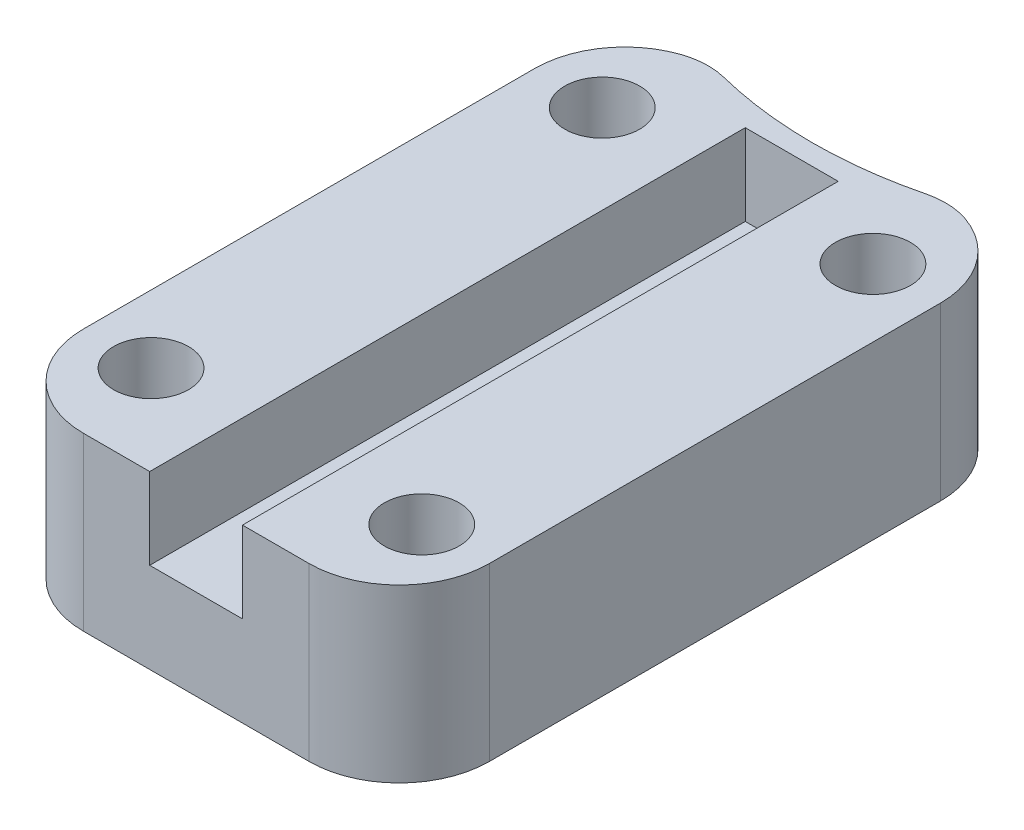
ISO-10303-21;
HEADER;
FILE_DESCRIPTION(('STEP AP214'),'2;1');
FILE_NAME('part.step','',(''),(''),'','','');
FILE_SCHEMA(('AUTOMOTIVE_DESIGN { 1 0 10303 214 1 1 1 1 }'));
ENDSEC;
DATA;
#1=APPLICATION_CONTEXT('core data for automotive mechanical design processes');
#2=APPLICATION_PROTOCOL_DEFINITION('international standard','automotive_design',2000,#1);
#3=PRODUCT_CONTEXT('',#1,'mechanical');
#4=PRODUCT('Part','Part','',(#3));
#5=PRODUCT_RELATED_PRODUCT_CATEGORY('part','',(#4));
#6=PRODUCT_DEFINITION_FORMATION('','',#4);
#7=PRODUCT_DEFINITION_CONTEXT('part definition',#1,'design');
#8=PRODUCT_DEFINITION('design','',#6,#7);
#9=PRODUCT_DEFINITION_SHAPE('','',#8);
#10=(LENGTH_UNIT() NAMED_UNIT(*) SI_UNIT(.MILLI.,.METRE.));
#11=(NAMED_UNIT(*) PLANE_ANGLE_UNIT() SI_UNIT($,.RADIAN.));
#12=(NAMED_UNIT(*) SI_UNIT($,.STERADIAN.) SOLID_ANGLE_UNIT());
#13=UNCERTAINTY_MEASURE_WITH_UNIT(LENGTH_MEASURE(1.E-05),#10,'distance_accuracy_value','');
#14=(GEOMETRIC_REPRESENTATION_CONTEXT(3) GLOBAL_UNCERTAINTY_ASSIGNED_CONTEXT((#13)) GLOBAL_UNIT_ASSIGNED_CONTEXT((#10,
#11,#12)) REPRESENTATION_CONTEXT('',''));
#15=CARTESIAN_POINT('',(0.,0.,0.));
#16=DIRECTION('',(0.,0.,1.));
#17=DIRECTION('',(1.,0.,0.));
#18=AXIS2_PLACEMENT_3D('',#15,#16,#17);
#19=CARTESIAN_POINT('',(-22.5,10.,35.));
#20=DIRECTION('',(1.,0.,0.));
#21=DIRECTION('',(0.,0.,-1.));
#22=AXIS2_PLACEMENT_3D('',#19,#20,#21);
#23=PLANE('',#22);
#24=DIRECTION('',(0.,0.,1.));
#25=VECTOR('',#24,1.);
#26=CARTESIAN_POINT('',(-22.5,0.,35.));
#27=LINE('',#26,#25);
#28=CARTESIAN_POINT('',(-22.5,0.,-25.));
#29=VERTEX_POINT('',#28);
#30=CARTESIAN_POINT('',(-22.5,0.,25.));
#31=VERTEX_POINT('',#30);
#32=EDGE_CURVE('E166',#29,#31,#27,.T.);
#33=ORIENTED_EDGE('',*,*,#32,.T.);
#34=DIRECTION('',(0.,-1.,0.));
#35=VECTOR('',#34,1.);
#36=CARTESIAN_POINT('',(-22.5,10.,25.));
#37=LINE('',#36,#35);
#38=CARTESIAN_POINT('',(-22.5,19.,25.));
#39=VERTEX_POINT('',#38);
#40=EDGE_CURVE('E268',#31,#39,#37,.F.);
#41=ORIENTED_EDGE('',*,*,#40,.T.);
#42=DIRECTION('',(0.,0.,1.));
#43=VECTOR('',#42,1.);
#44=CARTESIAN_POINT('',(-22.5,19.,35.));
#45=LINE('',#44,#43);
#46=CARTESIAN_POINT('',(-22.5,19.,-25.));
#47=VERTEX_POINT('',#46);
#48=EDGE_CURVE('E155',#47,#39,#45,.T.);
#49=ORIENTED_EDGE('',*,*,#48,.F.);
#50=DIRECTION('',(0.,-1.,0.));
#51=VECTOR('',#50,1.);
#52=CARTESIAN_POINT('',(-22.5,10.,-25.));
#53=LINE('',#52,#51);
#54=EDGE_CURVE('E265',#47,#29,#53,.T.);
#55=ORIENTED_EDGE('',*,*,#54,.T.);
#56=EDGE_LOOP('',(#33,#41,#49,#55));
#57=FACE_BOUND('',#56,.T.);
#58=ADVANCED_FACE('F35',(#57),#23,.F.);
#59=CARTESIAN_POINT('',(22.5,10.,35.));
#60=DIRECTION('',(0.,0.,-1.));
#61=DIRECTION('',(-1.,0.,0.));
#62=AXIS2_PLACEMENT_3D('',#59,#60,#61);
#63=PLANE('',#62);
#64=DIRECTION('',(1.,0.,0.));
#65=VECTOR('',#64,1.);
#66=CARTESIAN_POINT('',(22.5,0.,35.));
#67=LINE('',#66,#65);
#68=CARTESIAN_POINT('',(-12.5,0.,35.));
#69=VERTEX_POINT('',#68);
#70=CARTESIAN_POINT('',(12.5,0.,35.));
#71=VERTEX_POINT('',#70);
#72=EDGE_CURVE('E213',#69,#71,#67,.T.);
#73=ORIENTED_EDGE('',*,*,#72,.T.);
#74=DIRECTION('',(0.,-1.,0.));
#75=VECTOR('',#74,1.);
#76=CARTESIAN_POINT('',(12.5,10.,35.));
#77=LINE('',#76,#75);
#78=CARTESIAN_POINT('',(12.5,19.,35.));
#79=VERTEX_POINT('',#78);
#80=EDGE_CURVE('E255',#71,#79,#77,.F.);
#81=ORIENTED_EDGE('',*,*,#80,.T.);
#82=DIRECTION('',(1.,0.,0.));
#83=VECTOR('',#82,1.);
#84=CARTESIAN_POINT('',(5.15,19.,35.));
#85=LINE('',#84,#83);
#86=CARTESIAN_POINT('',(5.15,19.,35.));
#87=VERTEX_POINT('',#86);
#88=EDGE_CURVE('E181',#87,#79,#85,.T.);
#89=ORIENTED_EDGE('',*,*,#88,.F.);
#90=DIRECTION('',(0.,-1.,0.));
#91=VECTOR('',#90,1.);
#92=CARTESIAN_POINT('',(5.15,19.,35.));
#93=LINE('',#92,#91);
#94=CARTESIAN_POINT('',(5.15,10.,35.));
#95=VERTEX_POINT('',#94);
#96=EDGE_CURVE('E187',#87,#95,#93,.T.);
#97=ORIENTED_EDGE('',*,*,#96,.T.);
#98=DIRECTION('',(1.,0.,0.));
#99=VECTOR('',#98,1.);
#100=CARTESIAN_POINT('',(22.5,10.,35.));
#101=LINE('',#100,#99);
#102=CARTESIAN_POINT('',(-5.15,10.,35.));
#103=VERTEX_POINT('',#102);
#104=EDGE_CURVE('E163',#103,#95,#101,.T.);
#105=ORIENTED_EDGE('',*,*,#104,.F.);
#106=DIRECTION('',(0.,-1.,0.));
#107=VECTOR('',#106,1.);
#108=CARTESIAN_POINT('',(-5.15,19.,35.));
#109=LINE('',#108,#107);
#110=CARTESIAN_POINT('',(-5.15,19.,35.));
#111=VERTEX_POINT('',#110);
#112=EDGE_CURVE('E159',#111,#103,#109,.T.);
#113=ORIENTED_EDGE('',*,*,#112,.F.);
#114=DIRECTION('',(1.,0.,0.));
#115=VECTOR('',#114,1.);
#116=CARTESIAN_POINT('',(-5.15,19.,35.));
#117=LINE('',#116,#115);
#118=CARTESIAN_POINT('',(-12.5,19.,35.));
#119=VERTEX_POINT('',#118);
#120=EDGE_CURVE('E141',#119,#111,#117,.T.);
#121=ORIENTED_EDGE('',*,*,#120,.F.);
#122=DIRECTION('',(0.,-1.,0.));
#123=VECTOR('',#122,1.);
#124=CARTESIAN_POINT('',(-12.5,10.,35.));
#125=LINE('',#124,#123);
#126=EDGE_CURVE('E253',#119,#69,#125,.T.);
#127=ORIENTED_EDGE('',*,*,#126,.T.);
#128=EDGE_LOOP('',(#73,#81,#89,#97,#105,#113,#121,#127));
#129=FACE_BOUND('',#128,.T.);
#130=ADVANCED_FACE('F161',(#129),#63,.F.);
#131=CARTESIAN_POINT('',(22.5,10.,35.));
#132=DIRECTION('',(-1.,0.,0.));
#133=DIRECTION('',(0.,0.,1.));
#134=AXIS2_PLACEMENT_3D('',#131,#132,#133);
#135=PLANE('',#134);
#136=DIRECTION('',(0.,0.,-1.));
#137=VECTOR('',#136,1.);
#138=CARTESIAN_POINT('',(22.5,19.,35.));
#139=LINE('',#138,#137);
#140=CARTESIAN_POINT('',(22.5,19.,25.));
#141=VERTEX_POINT('',#140);
#142=CARTESIAN_POINT('',(22.5,19.,-25.));
#143=VERTEX_POINT('',#142);
#144=EDGE_CURVE('E184',#141,#143,#139,.T.);
#145=ORIENTED_EDGE('',*,*,#144,.F.);
#146=DIRECTION('',(0.,-1.,0.));
#147=VECTOR('',#146,1.);
#148=CARTESIAN_POINT('',(22.5,10.,25.));
#149=LINE('',#148,#147);
#150=CARTESIAN_POINT('',(22.5,0.,25.));
#151=VERTEX_POINT('',#150);
#152=EDGE_CURVE('E242',#141,#151,#149,.T.);
#153=ORIENTED_EDGE('',*,*,#152,.T.);
#154=DIRECTION('',(0.,0.,-1.));
#155=VECTOR('',#154,1.);
#156=CARTESIAN_POINT('',(22.5,0.,35.));
#157=LINE('',#156,#155);
#158=CARTESIAN_POINT('',(22.5,0.,-25.));
#159=VERTEX_POINT('',#158);
#160=EDGE_CURVE('E210',#151,#159,#157,.T.);
#161=ORIENTED_EDGE('',*,*,#160,.T.);
#162=DIRECTION('',(0.,-1.,0.));
#163=VECTOR('',#162,1.);
#164=CARTESIAN_POINT('',(22.5,10.,-25.));
#165=LINE('',#164,#163);
#166=EDGE_CURVE('E240',#159,#143,#165,.F.);
#167=ORIENTED_EDGE('',*,*,#166,.T.);
#168=EDGE_LOOP('',(#145,#153,#161,#167));
#169=FACE_BOUND('',#168,.T.);
#170=ADVANCED_FACE('F313',(#169),#135,.F.);
#171=CARTESIAN_POINT('',(0.,10.,0.));
#172=DIRECTION('',(0.,1.,0.));
#173=DIRECTION('',(0.,0.,1.));
#174=AXIS2_PLACEMENT_3D('',#171,#172,#173);
#175=PLANE('',#174);
#176=DIRECTION('',(0.363344208928321,0.,0.93165497145577));
#177=VECTOR('',#176,1.);
#178=CARTESIAN_POINT('',(5.15,10.,35.));
#179=LINE('',#178,#177);
#180=CARTESIAN_POINT('',(5.13022934751461,10.,34.9493058476664));
#181=VERTEX_POINT('',#180);
#182=EDGE_CURVE('E197',#181,#95,#179,.T.);
#183=ORIENTED_EDGE('',*,*,#182,.F.);
#184=DIRECTION('',(-0.000299785590505607,0.,0.999999955064299));
#185=VECTOR('',#184,1.);
#186=CARTESIAN_POINT('',(5.15,10.,-31.));
#187=LINE('',#186,#185);
#188=CARTESIAN_POINT('',(5.15,10.,-31.));
#189=VERTEX_POINT('',#188);
#190=EDGE_CURVE('E194',#189,#181,#187,.T.);
#191=ORIENTED_EDGE('',*,*,#190,.F.);
#192=DIRECTION('',(1.,0.,0.));
#193=VECTOR('',#192,1.);
#194=CARTESIAN_POINT('',(-5.15,10.,-31.));
#195=LINE('',#194,#193);
#196=CARTESIAN_POINT('',(-5.15,10.,-31.));
#197=VERTEX_POINT('',#196);
#198=EDGE_CURVE('E190',#197,#189,#195,.T.);
#199=ORIENTED_EDGE('',*,*,#198,.F.);
#200=DIRECTION('',(0.,0.,-1.));
#201=VECTOR('',#200,1.);
#202=CARTESIAN_POINT('',(-5.15,10.,35.));
#203=LINE('',#202,#201);
#204=EDGE_CURVE('E188',#103,#197,#203,.T.);
#205=ORIENTED_EDGE('',*,*,#204,.F.);
#206=ORIENTED_EDGE('',*,*,#104,.T.);
#207=EDGE_LOOP('',(#183,#191,#199,#205,#206));
#208=FACE_BOUND('',#207,.T.);
#209=ADVANCED_FACE('F397',(#208),#175,.T.);
#210=CARTESIAN_POINT('',(0.,0.,0.));
#211=DIRECTION('',(0.,1.,0.));
#212=DIRECTION('',(0.,0.,1.));
#213=AXIS2_PLACEMENT_3D('',#210,#211,#212);
#214=PLANE('',#213);
#215=CARTESIAN_POINT('',(15.,0.,25.));
#216=DIRECTION('',(0.,1.,0.));
#217=DIRECTION('',(0.,0.,1.));
#218=AXIS2_PLACEMENT_3D('',#215,#216,#217);
#219=CIRCLE('',#218,5.15000000000001);
#220=CARTESIAN_POINT('',(15.,0.,30.15));
#221=VERTEX_POINT('',#220);
#222=EDGE_CURVE('E228',#221,#221,#219,.T.);
#223=ORIENTED_EDGE('',*,*,#222,.T.);
#224=EDGE_LOOP('',(#223));
#225=FACE_BOUND('',#224,.T.);
#226=CARTESIAN_POINT('',(-15.,0.,25.));
#227=DIRECTION('',(0.,1.,0.));
#228=DIRECTION('',(0.,0.,1.));
#229=AXIS2_PLACEMENT_3D('',#226,#227,#228);
#230=CIRCLE('',#229,5.15000000000001);
#231=CARTESIAN_POINT('',(-15.,0.,30.15));
#232=VERTEX_POINT('',#231);
#233=EDGE_CURVE('E225',#232,#232,#230,.T.);
#234=ORIENTED_EDGE('',*,*,#233,.T.);
#235=EDGE_LOOP('',(#234));
#236=FACE_BOUND('',#235,.T.);
#237=CARTESIAN_POINT('',(-15.,0.,-25.));
#238=DIRECTION('',(0.,1.,0.));
#239=DIRECTION('',(0.,0.,1.));
#240=AXIS2_PLACEMENT_3D('',#237,#238,#239);
#241=CIRCLE('',#240,5.15000000000001);
#242=CARTESIAN_POINT('',(-15.,0.,-19.85));
#243=VERTEX_POINT('',#242);
#244=EDGE_CURVE('E222',#243,#243,#241,.T.);
#245=ORIENTED_EDGE('',*,*,#244,.T.);
#246=EDGE_LOOP('',(#245));
#247=FACE_BOUND('',#246,.T.);
#248=CARTESIAN_POINT('',(15.,0.,-25.));
#249=DIRECTION('',(0.,1.,0.));
#250=DIRECTION('',(0.,0.,1.));
#251=AXIS2_PLACEMENT_3D('',#248,#249,#250);
#252=CIRCLE('',#251,5.15000000000001);
#253=CARTESIAN_POINT('',(15.,0.,-19.85));
#254=VERTEX_POINT('',#253);
#255=EDGE_CURVE('E219',#254,#254,#252,.T.);
#256=ORIENTED_EDGE('',*,*,#255,.T.);
#257=EDGE_LOOP('',(#256));
#258=FACE_BOUND('',#257,.T.);
#259=CARTESIAN_POINT('',(-12.5,0.,-25.));
#260=DIRECTION('',(0.,1.,0.));
#261=DIRECTION('',(0.,0.,1.));
#262=AXIS2_PLACEMENT_3D('',#259,#260,#261);
#263=CIRCLE('',#262,10.);
#264=CARTESIAN_POINT('',(-15.7226987115137,0.,-34.46647838506));
#265=VERTEX_POINT('',#264);
#266=EDGE_CURVE('E247',#29,#265,#263,.F.);
#267=ORIENTED_EDGE('',*,*,#266,.T.);
#268=CARTESIAN_POINT('',(-13.1445397423027,0.,-26.893295677012));
#269=DIRECTION('',(0.,1.,0.));
#270=DIRECTION('',(0.,0.,1.));
#271=AXIS2_PLACEMENT_3D('',#268,#269,#270);
#272=CIRCLE('',#271,8.);
#273=CARTESIAN_POINT('',(-11.1972005212208,0.,-34.6526687159911));
#274=VERTEX_POINT('',#273);
#275=EDGE_CURVE('E43',#265,#274,#272,.F.);
#276=ORIENTED_EDGE('',*,*,#275,.T.);
#277=CARTESIAN_POINT('',(0.,0.,-79.2690636901211));
#278=DIRECTION('',(0.,1.,0.));
#279=DIRECTION('',(0.,0.,1.));
#280=AXIS2_PLACEMENT_3D('',#277,#278,#279);
#281=CIRCLE('',#280,46.);
#282=CARTESIAN_POINT('',(11.1972005212208,0.,-34.6526687159911));
#283=VERTEX_POINT('',#282);
#284=EDGE_CURVE('E284',#274,#283,#281,.T.);
#285=ORIENTED_EDGE('',*,*,#284,.T.);
#286=CARTESIAN_POINT('',(13.1445397423027,0.,-26.893295677012));
#287=DIRECTION('',(0.,1.,0.));
#288=DIRECTION('',(0.,0.,1.));
#289=AXIS2_PLACEMENT_3D('',#286,#287,#288);
#290=CIRCLE('',#289,8.);
#291=CARTESIAN_POINT('',(15.7226987115137,0.,-34.46647838506));
#292=VERTEX_POINT('',#291);
#293=EDGE_CURVE('E50',#283,#292,#290,.F.);
#294=ORIENTED_EDGE('',*,*,#293,.T.);
#295=CARTESIAN_POINT('',(12.5,0.,-25.));
#296=DIRECTION('',(0.,1.,0.));
#297=DIRECTION('',(0.,0.,1.));
#298=AXIS2_PLACEMENT_3D('',#295,#296,#297);
#299=CIRCLE('',#298,10.);
#300=EDGE_CURVE('E245',#292,#159,#299,.F.);
#301=ORIENTED_EDGE('',*,*,#300,.T.);
#302=ORIENTED_EDGE('',*,*,#160,.F.);
#303=CARTESIAN_POINT('',(12.5,0.,25.));
#304=DIRECTION('',(0.,1.,0.));
#305=DIRECTION('',(0.,0.,1.));
#306=AXIS2_PLACEMENT_3D('',#303,#304,#305);
#307=CIRCLE('',#306,10.);
#308=EDGE_CURVE('E251',#151,#71,#307,.F.);
#309=ORIENTED_EDGE('',*,*,#308,.T.);
#310=ORIENTED_EDGE('',*,*,#72,.F.);
#311=CARTESIAN_POINT('',(-12.5,0.,25.));
#312=DIRECTION('',(0.,1.,0.));
#313=DIRECTION('',(0.,0.,1.));
#314=AXIS2_PLACEMENT_3D('',#311,#312,#313);
#315=CIRCLE('',#314,10.);
#316=EDGE_CURVE('E249',#69,#31,#315,.F.);
#317=ORIENTED_EDGE('',*,*,#316,.T.);
#318=ORIENTED_EDGE('',*,*,#32,.F.);
#319=EDGE_LOOP('',(#267,#276,#285,#294,#301,#302,#309,#310,#317,#318));
#320=FACE_BOUND('',#319,.T.);
#321=ADVANCED_FACE('F283',(#225,#236,#247,#258,#320),#214,.F.);
#322=CARTESIAN_POINT('',(-15.,10.,-25.));
#323=DIRECTION('',(0.,-1.,0.));
#324=DIRECTION('',(0.,0.,-1.));
#325=AXIS2_PLACEMENT_3D('',#322,#323,#324);
#326=CYLINDRICAL_SURFACE('',#325,4.15);
#327=CARTESIAN_POINT('',(-15.,1.19175359259421,-25.));
#328=DIRECTION('',(0.,1.,0.));
#329=DIRECTION('',(0.,0.,1.));
#330=AXIS2_PLACEMENT_3D('',#327,#328,#329);
#331=CIRCLE('',#330,4.15);
#332=CARTESIAN_POINT('',(-15.,1.19175359259421,-20.85));
#333=VERTEX_POINT('',#332);
#334=EDGE_CURVE('E234',#333,#333,#331,.F.);
#335=ORIENTED_EDGE('',*,*,#334,.T.);
#336=EDGE_LOOP('',(#335));
#337=FACE_BOUND('',#336,.T.);
#338=CARTESIAN_POINT('',(-15.,19.,-25.));
#339=DIRECTION('',(0.,1.,0.));
#340=DIRECTION('',(0.,0.,1.));
#341=AXIS2_PLACEMENT_3D('',#338,#339,#340);
#342=CIRCLE('',#341,4.15);
#343=CARTESIAN_POINT('',(-15.,19.,-20.85));
#344=VERTEX_POINT('',#343);
#345=EDGE_CURVE('E191',#344,#344,#342,.T.);
#346=ORIENTED_EDGE('',*,*,#345,.T.);
#347=EDGE_LOOP('',(#346));
#348=FACE_BOUND('',#347,.T.);
#349=ADVANCED_FACE('F392',(#337,#348),#326,.F.);
#350=CARTESIAN_POINT('',(15.,10.,-25.));
#351=DIRECTION('',(0.,-1.,0.));
#352=DIRECTION('',(0.,0.,-1.));
#353=AXIS2_PLACEMENT_3D('',#350,#351,#352);
#354=CYLINDRICAL_SURFACE('',#353,4.15);
#355=CARTESIAN_POINT('',(15.,1.19175359259421,-25.));
#356=DIRECTION('',(0.,1.,0.));
#357=DIRECTION('',(0.,0.,1.));
#358=AXIS2_PLACEMENT_3D('',#355,#356,#357);
#359=CIRCLE('',#358,4.15);
#360=CARTESIAN_POINT('',(15.,1.19175359259421,-20.85));
#361=VERTEX_POINT('',#360);
#362=EDGE_CURVE('E237',#361,#361,#359,.F.);
#363=ORIENTED_EDGE('',*,*,#362,.T.);
#364=EDGE_LOOP('',(#363));
#365=FACE_BOUND('',#364,.T.);
#366=CARTESIAN_POINT('',(15.,19.,-25.));
#367=DIRECTION('',(0.,1.,0.));
#368=DIRECTION('',(0.,0.,1.));
#369=AXIS2_PLACEMENT_3D('',#366,#367,#368);
#370=CIRCLE('',#369,4.15);
#371=CARTESIAN_POINT('',(15.,19.,-20.85));
#372=VERTEX_POINT('',#371);
#373=EDGE_CURVE('E583',#372,#372,#370,.T.);
#374=ORIENTED_EDGE('',*,*,#373,.T.);
#375=EDGE_LOOP('',(#374));
#376=FACE_BOUND('',#375,.T.);
#377=ADVANCED_FACE('F388',(#365,#376),#354,.F.);
#378=CARTESIAN_POINT('',(15.,10.,25.));
#379=DIRECTION('',(0.,-1.,0.));
#380=DIRECTION('',(0.,0.,-1.));
#381=AXIS2_PLACEMENT_3D('',#378,#379,#380);
#382=CYLINDRICAL_SURFACE('',#381,4.15);
#383=CARTESIAN_POINT('',(15.,1.19175359259421,25.));
#384=DIRECTION('',(0.,1.,0.));
#385=DIRECTION('',(0.,0.,1.));
#386=AXIS2_PLACEMENT_3D('',#383,#384,#385);
#387=CIRCLE('',#386,4.15);
#388=CARTESIAN_POINT('',(15.,1.19175359259421,29.15));
#389=VERTEX_POINT('',#388);
#390=EDGE_CURVE('E209',#389,#389,#387,.F.);
#391=ORIENTED_EDGE('',*,*,#390,.T.);
#392=EDGE_LOOP('',(#391));
#393=FACE_BOUND('',#392,.T.);
#394=CARTESIAN_POINT('',(15.,19.,25.));
#395=DIRECTION('',(0.,1.,0.));
#396=DIRECTION('',(0.,0.,1.));
#397=AXIS2_PLACEMENT_3D('',#394,#395,#396);
#398=CIRCLE('',#397,4.15);
#399=CARTESIAN_POINT('',(15.,19.,29.15));
#400=VERTEX_POINT('',#399);
#401=EDGE_CURVE('E585',#400,#400,#398,.T.);
#402=ORIENTED_EDGE('',*,*,#401,.T.);
#403=EDGE_LOOP('',(#402));
#404=FACE_BOUND('',#403,.T.);
#405=ADVANCED_FACE('F384',(#393,#404),#382,.F.);
#406=CARTESIAN_POINT('',(-15.,10.,25.));
#407=DIRECTION('',(0.,-1.,0.));
#408=DIRECTION('',(0.,0.,-1.));
#409=AXIS2_PLACEMENT_3D('',#406,#407,#408);
#410=CYLINDRICAL_SURFACE('',#409,4.15);
#411=CARTESIAN_POINT('',(-15.,1.19175359259421,25.));
#412=DIRECTION('',(0.,1.,0.));
#413=DIRECTION('',(0.,0.,1.));
#414=AXIS2_PLACEMENT_3D('',#411,#412,#413);
#415=CIRCLE('',#414,4.15);
#416=CARTESIAN_POINT('',(-15.,1.19175359259421,29.15));
#417=VERTEX_POINT('',#416);
#418=EDGE_CURVE('E231',#417,#417,#415,.F.);
#419=ORIENTED_EDGE('',*,*,#418,.T.);
#420=EDGE_LOOP('',(#419));
#421=FACE_BOUND('',#420,.T.);
#422=CARTESIAN_POINT('',(-15.,19.,25.));
#423=DIRECTION('',(0.,1.,0.));
#424=DIRECTION('',(0.,0.,1.));
#425=AXIS2_PLACEMENT_3D('',#422,#423,#424);
#426=CIRCLE('',#425,4.15);
#427=CARTESIAN_POINT('',(-15.,19.,29.15));
#428=VERTEX_POINT('',#427);
#429=EDGE_CURVE('E292',#428,#428,#426,.T.);
#430=ORIENTED_EDGE('',*,*,#429,.T.);
#431=EDGE_LOOP('',(#430));
#432=FACE_BOUND('',#431,.T.);
#433=ADVANCED_FACE('F368',(#421,#432),#410,.F.);
#434=CARTESIAN_POINT('',(0.,19.,0.));
#435=DIRECTION('',(0.,1.,0.));
#436=DIRECTION('',(0.,0.,1.));
#437=AXIS2_PLACEMENT_3D('',#434,#435,#436);
#438=PLANE('',#437);
#439=CARTESIAN_POINT('',(0.,19.,-79.2690636901211));
#440=DIRECTION('',(0.,1.,0.));
#441=DIRECTION('',(0.,0.,1.));
#442=AXIS2_PLACEMENT_3D('',#439,#440,#441);
#443=CIRCLE('',#442,46.);
#444=CARTESIAN_POINT('',(-11.1972005212208,19.,-34.6526687159911));
#445=VERTEX_POINT('',#444);
#446=CARTESIAN_POINT('',(11.1972005212208,19.,-34.6526687159911));
#447=VERTEX_POINT('',#446);
#448=EDGE_CURVE('E293',#445,#447,#443,.T.);
#449=ORIENTED_EDGE('',*,*,#448,.F.);
#450=CARTESIAN_POINT('',(-13.1445397423027,19.,-26.893295677012));
#451=DIRECTION('',(0.,1.,0.));
#452=DIRECTION('',(0.,0.,1.));
#453=AXIS2_PLACEMENT_3D('',#450,#451,#452);
#454=CIRCLE('',#453,8.);
#455=CARTESIAN_POINT('',(-15.7226987115137,19.,-34.46647838506));
#456=VERTEX_POINT('',#455);
#457=EDGE_CURVE('E278',#445,#456,#454,.T.);
#458=ORIENTED_EDGE('',*,*,#457,.T.);
#459=CARTESIAN_POINT('',(-12.5,19.,-25.));
#460=DIRECTION('',(0.,1.,0.));
#461=DIRECTION('',(0.,0.,1.));
#462=AXIS2_PLACEMENT_3D('',#459,#460,#461);
#463=CIRCLE('',#462,10.);
#464=EDGE_CURVE('E260',#456,#47,#463,.T.);
#465=ORIENTED_EDGE('',*,*,#464,.T.);
#466=ORIENTED_EDGE('',*,*,#48,.T.);
#467=CARTESIAN_POINT('',(-12.5,19.,25.));
#468=DIRECTION('',(0.,1.,0.));
#469=DIRECTION('',(0.,0.,1.));
#470=AXIS2_PLACEMENT_3D('',#467,#468,#469);
#471=CIRCLE('',#470,10.);
#472=EDGE_CURVE('E151',#39,#119,#471,.T.);
#473=ORIENTED_EDGE('',*,*,#472,.T.);
#474=ORIENTED_EDGE('',*,*,#120,.T.);
#475=DIRECTION('',(0.,0.,-1.));
#476=VECTOR('',#475,1.);
#477=CARTESIAN_POINT('',(-5.15,19.,35.));
#478=LINE('',#477,#476);
#479=CARTESIAN_POINT('',(-5.15,19.,-31.));
#480=VERTEX_POINT('',#479);
#481=EDGE_CURVE('E147',#111,#480,#478,.T.);
#482=ORIENTED_EDGE('',*,*,#481,.T.);
#483=DIRECTION('',(1.,0.,0.));
#484=VECTOR('',#483,1.);
#485=CARTESIAN_POINT('',(-5.15,19.,-31.));
#486=LINE('',#485,#484);
#487=CARTESIAN_POINT('',(5.15,19.,-31.));
#488=VERTEX_POINT('',#487);
#489=EDGE_CURVE('E172',#480,#488,#486,.T.);
#490=ORIENTED_EDGE('',*,*,#489,.T.);
#491=DIRECTION('',(-0.000299785590505607,0.,0.999999955064299));
#492=VECTOR('',#491,1.);
#493=CARTESIAN_POINT('',(5.15,19.,-31.));
#494=LINE('',#493,#492);
#495=CARTESIAN_POINT('',(5.13022934751461,19.,34.9493058476664));
#496=VERTEX_POINT('',#495);
#497=EDGE_CURVE('E174',#488,#496,#494,.T.);
#498=ORIENTED_EDGE('',*,*,#497,.T.);
#499=DIRECTION('',(0.363344208928321,0.,0.93165497145577));
#500=VECTOR('',#499,1.);
#501=CARTESIAN_POINT('',(5.15,19.,35.));
#502=LINE('',#501,#500);
#503=EDGE_CURVE('E179',#496,#87,#502,.T.);
#504=ORIENTED_EDGE('',*,*,#503,.T.);
#505=ORIENTED_EDGE('',*,*,#88,.T.);
#506=CARTESIAN_POINT('',(12.5,19.,25.));
#507=DIRECTION('',(0.,1.,0.));
#508=DIRECTION('',(0.,0.,1.));
#509=AXIS2_PLACEMENT_3D('',#506,#507,#508);
#510=CIRCLE('',#509,10.);
#511=EDGE_CURVE('E263',#79,#141,#510,.T.);
#512=ORIENTED_EDGE('',*,*,#511,.T.);
#513=ORIENTED_EDGE('',*,*,#144,.T.);
#514=CARTESIAN_POINT('',(12.5,19.,-25.));
#515=DIRECTION('',(0.,1.,0.));
#516=DIRECTION('',(0.,0.,1.));
#517=AXIS2_PLACEMENT_3D('',#514,#515,#516);
#518=CIRCLE('',#517,10.);
#519=CARTESIAN_POINT('',(15.7226987115137,19.,-34.46647838506));
#520=VERTEX_POINT('',#519);
#521=EDGE_CURVE('E257',#143,#520,#518,.T.);
#522=ORIENTED_EDGE('',*,*,#521,.T.);
#523=CARTESIAN_POINT('',(13.1445397423027,19.,-26.893295677012));
#524=DIRECTION('',(0.,1.,0.));
#525=DIRECTION('',(0.,0.,1.));
#526=AXIS2_PLACEMENT_3D('',#523,#524,#525);
#527=CIRCLE('',#526,8.);
#528=EDGE_CURVE('E276',#520,#447,#527,.T.);
#529=ORIENTED_EDGE('',*,*,#528,.T.);
#530=EDGE_LOOP('',(#449,#458,#465,#466,#473,#474,#482,#490,#498,#504,#505,#512,#513,#522,#529));
#531=FACE_BOUND('',#530,.T.);
#532=ORIENTED_EDGE('',*,*,#401,.F.);
#533=EDGE_LOOP('',(#532));
#534=FACE_BOUND('',#533,.T.);
#535=ORIENTED_EDGE('',*,*,#345,.F.);
#536=EDGE_LOOP('',(#535));
#537=FACE_BOUND('',#536,.T.);
#538=ORIENTED_EDGE('',*,*,#373,.F.);
#539=EDGE_LOOP('',(#538));
#540=FACE_BOUND('',#539,.T.);
#541=ORIENTED_EDGE('',*,*,#429,.F.);
#542=EDGE_LOOP('',(#541));
#543=FACE_BOUND('',#542,.T.);
#544=ADVANCED_FACE('F144',(#531,#534,#537,#540,#543),#438,.T.);
#545=CARTESIAN_POINT('',(-5.15,19.,35.));
#546=DIRECTION('',(-1.,0.,0.));
#547=DIRECTION('',(0.,0.,1.));
#548=AXIS2_PLACEMENT_3D('',#545,#546,#547);
#549=PLANE('',#548);
#550=ORIENTED_EDGE('',*,*,#204,.T.);
#551=DIRECTION('',(0.,-1.,0.));
#552=VECTOR('',#551,1.);
#553=CARTESIAN_POINT('',(-5.15,19.,-31.));
#554=LINE('',#553,#552);
#555=EDGE_CURVE('E167',#480,#197,#554,.T.);
#556=ORIENTED_EDGE('',*,*,#555,.F.);
#557=ORIENTED_EDGE('',*,*,#481,.F.);
#558=ORIENTED_EDGE('',*,*,#112,.T.);
#559=EDGE_LOOP('',(#550,#556,#557,#558));
#560=FACE_BOUND('',#559,.T.);
#561=ADVANCED_FACE('F169',(#560),#549,.F.);
#562=CARTESIAN_POINT('',(-5.15,19.,-31.));
#563=DIRECTION('',(0.,0.,-1.));
#564=DIRECTION('',(-1.,0.,0.));
#565=AXIS2_PLACEMENT_3D('',#562,#563,#564);
#566=PLANE('',#565);
#567=ORIENTED_EDGE('',*,*,#198,.T.);
#568=DIRECTION('',(0.,-1.,0.));
#569=VECTOR('',#568,1.);
#570=CARTESIAN_POINT('',(5.15,19.,-31.));
#571=LINE('',#570,#569);
#572=EDGE_CURVE('E204',#488,#189,#571,.T.);
#573=ORIENTED_EDGE('',*,*,#572,.F.);
#574=ORIENTED_EDGE('',*,*,#489,.F.);
#575=ORIENTED_EDGE('',*,*,#555,.T.);
#576=EDGE_LOOP('',(#567,#573,#574,#575));
#577=FACE_BOUND('',#576,.T.);
#578=ADVANCED_FACE('F375',(#577),#566,.F.);
#579=CARTESIAN_POINT('',(5.15,19.,-31.));
#580=DIRECTION('',(0.999999955064299,0.,0.000299785590505607));
#581=DIRECTION('',(0.000299785590505607,0.,-0.999999955064299));
#582=AXIS2_PLACEMENT_3D('',#579,#580,#581);
#583=PLANE('',#582);
#584=ORIENTED_EDGE('',*,*,#190,.T.);
#585=DIRECTION('',(0.,-1.,0.));
#586=VECTOR('',#585,1.);
#587=CARTESIAN_POINT('',(5.13022934751461,19.,34.9493058476664));
#588=LINE('',#587,#586);
#589=EDGE_CURVE('E201',#496,#181,#588,.T.);
#590=ORIENTED_EDGE('',*,*,#589,.F.);
#591=ORIENTED_EDGE('',*,*,#497,.F.);
#592=ORIENTED_EDGE('',*,*,#572,.T.);
#593=EDGE_LOOP('',(#584,#590,#591,#592));
#594=FACE_BOUND('',#593,.T.);
#595=ADVANCED_FACE('F371',(#594),#583,.F.);
#596=CARTESIAN_POINT('',(5.15,19.,35.));
#597=DIRECTION('',(0.931654971455771,0.,-0.363344208928321));
#598=DIRECTION('',(-0.363344208928321,0.,-0.931654971455771));
#599=AXIS2_PLACEMENT_3D('',#596,#597,#598);
#600=PLANE('',#599);
#601=ORIENTED_EDGE('',*,*,#182,.T.);
#602=ORIENTED_EDGE('',*,*,#96,.F.);
#603=ORIENTED_EDGE('',*,*,#503,.F.);
#604=ORIENTED_EDGE('',*,*,#589,.T.);
#605=EDGE_LOOP('',(#601,#602,#603,#604));
#606=FACE_BOUND('',#605,.T.);
#607=ADVANCED_FACE('F338',(#606),#600,.F.);
#608=CARTESIAN_POINT('',(15.,1.19175359259421,25.));
#609=DIRECTION('',(0.,-1.,0.));
#610=DIRECTION('',(0.,0.,-1.));
#611=AXIS2_PLACEMENT_3D('',#608,#609,#610);
#612=CONICAL_SURFACE('',#611,4.15,0.698131700797736);
#613=ORIENTED_EDGE('',*,*,#222,.F.);
#614=EDGE_LOOP('',(#613));
#615=FACE_BOUND('',#614,.T.);
#616=ORIENTED_EDGE('',*,*,#390,.F.);
#617=EDGE_LOOP('',(#616));
#618=FACE_BOUND('',#617,.T.);
#619=ADVANCED_FACE('F334',(#615,#618),#612,.F.);
#620=CARTESIAN_POINT('',(-15.,1.19175359259421,25.));
#621=DIRECTION('',(0.,-1.,0.));
#622=DIRECTION('',(0.,0.,-1.));
#623=AXIS2_PLACEMENT_3D('',#620,#621,#622);
#624=CONICAL_SURFACE('',#623,4.15,0.698131700797736);
#625=ORIENTED_EDGE('',*,*,#233,.F.);
#626=EDGE_LOOP('',(#625));
#627=FACE_BOUND('',#626,.T.);
#628=ORIENTED_EDGE('',*,*,#418,.F.);
#629=EDGE_LOOP('',(#628));
#630=FACE_BOUND('',#629,.T.);
#631=ADVANCED_FACE('F337',(#627,#630),#624,.F.);
#632=CARTESIAN_POINT('',(-15.,1.19175359259421,-25.));
#633=DIRECTION('',(0.,-1.,0.));
#634=DIRECTION('',(0.,0.,-1.));
#635=AXIS2_PLACEMENT_3D('',#632,#633,#634);
#636=CONICAL_SURFACE('',#635,4.15,0.698131700797736);
#637=ORIENTED_EDGE('',*,*,#244,.F.);
#638=EDGE_LOOP('',(#637));
#639=FACE_BOUND('',#638,.T.);
#640=ORIENTED_EDGE('',*,*,#334,.F.);
#641=EDGE_LOOP('',(#640));
#642=FACE_BOUND('',#641,.T.);
#643=ADVANCED_FACE('F342',(#639,#642),#636,.F.);
#644=CARTESIAN_POINT('',(15.,1.19175359259421,-25.));
#645=DIRECTION('',(0.,-1.,0.));
#646=DIRECTION('',(0.,0.,-1.));
#647=AXIS2_PLACEMENT_3D('',#644,#645,#646);
#648=CONICAL_SURFACE('',#647,4.15,0.698131700797735);
#649=ORIENTED_EDGE('',*,*,#255,.F.);
#650=EDGE_LOOP('',(#649));
#651=FACE_BOUND('',#650,.T.);
#652=ORIENTED_EDGE('',*,*,#362,.F.);
#653=EDGE_LOOP('',(#652));
#654=FACE_BOUND('',#653,.T.);
#655=ADVANCED_FACE('F346',(#651,#654),#648,.F.);
#656=CARTESIAN_POINT('',(12.5,10.,25.));
#657=DIRECTION('',(0.,-1.,0.));
#658=DIRECTION('',(0.,0.,-1.));
#659=AXIS2_PLACEMENT_3D('',#656,#657,#658);
#660=CYLINDRICAL_SURFACE('',#659,10.);
#661=ORIENTED_EDGE('',*,*,#511,.F.);
#662=ORIENTED_EDGE('',*,*,#80,.F.);
#663=ORIENTED_EDGE('',*,*,#308,.F.);
#664=ORIENTED_EDGE('',*,*,#152,.F.);
#665=EDGE_LOOP('',(#661,#662,#663,#664));
#666=FACE_BOUND('',#665,.T.);
#667=ADVANCED_FACE('F308',(#666),#660,.T.);
#668=CARTESIAN_POINT('',(-12.5,10.,25.));
#669=DIRECTION('',(0.,-1.,0.));
#670=DIRECTION('',(0.,0.,-1.));
#671=AXIS2_PLACEMENT_3D('',#668,#669,#670);
#672=CYLINDRICAL_SURFACE('',#671,10.);
#673=ORIENTED_EDGE('',*,*,#472,.F.);
#674=ORIENTED_EDGE('',*,*,#40,.F.);
#675=ORIENTED_EDGE('',*,*,#316,.F.);
#676=ORIENTED_EDGE('',*,*,#126,.F.);
#677=EDGE_LOOP('',(#673,#674,#675,#676));
#678=FACE_BOUND('',#677,.T.);
#679=ADVANCED_FACE('F303',(#678),#672,.T.);
#680=CARTESIAN_POINT('',(-12.5,10.,-25.));
#681=DIRECTION('',(0.,-1.,0.));
#682=DIRECTION('',(0.,0.,-1.));
#683=AXIS2_PLACEMENT_3D('',#680,#681,#682);
#684=CYLINDRICAL_SURFACE('',#683,10.);
#685=ORIENTED_EDGE('',*,*,#464,.F.);
#686=DIRECTION('',(0.,-1.,0.));
#687=VECTOR('',#686,1.);
#688=CARTESIAN_POINT('',(-15.7226987115137,10.,-34.46647838506));
#689=LINE('',#688,#687);
#690=EDGE_CURVE('E58',#456,#265,#689,.T.);
#691=ORIENTED_EDGE('',*,*,#690,.T.);
#692=ORIENTED_EDGE('',*,*,#266,.F.);
#693=ORIENTED_EDGE('',*,*,#54,.F.);
#694=EDGE_LOOP('',(#685,#691,#692,#693));
#695=FACE_BOUND('',#694,.T.);
#696=ADVANCED_FACE('F298',(#695),#684,.T.);
#697=CARTESIAN_POINT('',(12.5,10.,-25.));
#698=DIRECTION('',(0.,-1.,0.));
#699=DIRECTION('',(0.,0.,-1.));
#700=AXIS2_PLACEMENT_3D('',#697,#698,#699);
#701=CYLINDRICAL_SURFACE('',#700,10.);
#702=ORIENTED_EDGE('',*,*,#300,.F.);
#703=DIRECTION('',(0.,-1.,0.));
#704=VECTOR('',#703,1.);
#705=CARTESIAN_POINT('',(15.7226987115137,10.,-34.46647838506));
#706=LINE('',#705,#704);
#707=EDGE_CURVE('E11',#292,#520,#706,.F.);
#708=ORIENTED_EDGE('',*,*,#707,.T.);
#709=ORIENTED_EDGE('',*,*,#521,.F.);
#710=ORIENTED_EDGE('',*,*,#166,.F.);
#711=EDGE_LOOP('',(#702,#708,#709,#710));
#712=FACE_BOUND('',#711,.T.);
#713=ADVANCED_FACE('F317',(#712),#701,.T.);
#714=CARTESIAN_POINT('',(0.,0.,-79.2690636901211));
#715=DIRECTION('',(0.,1.,0.));
#716=DIRECTION('',(0.,0.,1.));
#717=AXIS2_PLACEMENT_3D('',#714,#715,#716);
#718=CYLINDRICAL_SURFACE('',#717,46.);
#719=ORIENTED_EDGE('',*,*,#284,.F.);
#720=DIRECTION('',(0.,1.,0.));
#721=VECTOR('',#720,1.);
#722=CARTESIAN_POINT('',(-11.1972005212208,0.,-34.6526687159911));
#723=LINE('',#722,#721);
#724=EDGE_CURVE('E273',#274,#445,#723,.T.);
#725=ORIENTED_EDGE('',*,*,#724,.T.);
#726=ORIENTED_EDGE('',*,*,#448,.T.);
#727=DIRECTION('',(0.,1.,0.));
#728=VECTOR('',#727,1.);
#729=CARTESIAN_POINT('',(11.1972005212208,0.,-34.6526687159911));
#730=LINE('',#729,#728);
#731=EDGE_CURVE('E270',#447,#283,#730,.F.);
#732=ORIENTED_EDGE('',*,*,#731,.T.);
#733=EDGE_LOOP('',(#719,#725,#726,#732));
#734=FACE_BOUND('',#733,.T.);
#735=ADVANCED_FACE('F289',(#734),#718,.F.);
#736=CARTESIAN_POINT('',(-13.1445397423027,10.,-26.893295677012));
#737=DIRECTION('',(0.,-1.,0.));
#738=DIRECTION('',(0.,0.,-1.));
#739=AXIS2_PLACEMENT_3D('',#736,#737,#738);
#740=CYLINDRICAL_SURFACE('',#739,8.);
#741=ORIENTED_EDGE('',*,*,#275,.F.);
#742=ORIENTED_EDGE('',*,*,#690,.F.);
#743=ORIENTED_EDGE('',*,*,#457,.F.);
#744=ORIENTED_EDGE('',*,*,#724,.F.);
#745=EDGE_LOOP('',(#741,#742,#743,#744));
#746=FACE_BOUND('',#745,.T.);
#747=ADVANCED_FACE('F295',(#746),#740,.T.);
#748=CARTESIAN_POINT('',(13.1445397423027,10.,-26.893295677012));
#749=DIRECTION('',(0.,1.,0.));
#750=DIRECTION('',(0.,0.,1.));
#751=AXIS2_PLACEMENT_3D('',#748,#749,#750);
#752=CYLINDRICAL_SURFACE('',#751,8.);
#753=ORIENTED_EDGE('',*,*,#528,.F.);
#754=ORIENTED_EDGE('',*,*,#707,.F.);
#755=ORIENTED_EDGE('',*,*,#293,.F.);
#756=ORIENTED_EDGE('',*,*,#731,.F.);
#757=EDGE_LOOP('',(#753,#754,#755,#756));
#758=FACE_BOUND('',#757,.T.);
#759=ADVANCED_FACE('F37',(#758),#752,.T.);
#760=CLOSED_SHELL('',(#58,#130,#170,#209,#321,#349,#377,#405,#433,#544,#561,#578,#595,#607,#619,
#631,#643,#655,#667,#679,#696,#713,#735,#747,#759));
#761=MANIFOLD_SOLID_BREP('B2',#760);
#762=ADVANCED_BREP_SHAPE_REPRESENTATION('',(#18,#761),#14);
#763=SHAPE_DEFINITION_REPRESENTATION(#9,#762);
ENDSEC;
END-ISO-10303-21;
